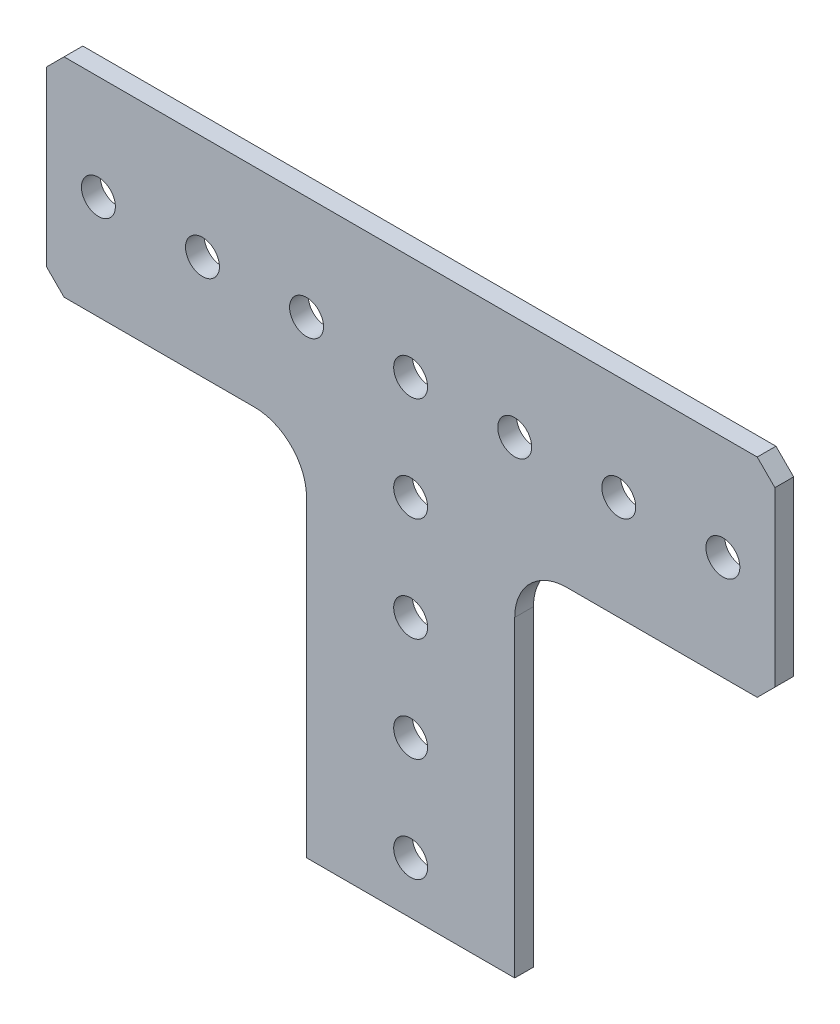
ISO-10303-21;
HEADER;
FILE_DESCRIPTION(('STEP AP214'),'2;1');
FILE_NAME('part.step','',(''),(''),'','','');
FILE_SCHEMA(('AUTOMOTIVE_DESIGN { 1 0 10303 214 1 1 1 1 }'));
ENDSEC;
DATA;
#1=APPLICATION_CONTEXT('core data for automotive mechanical design processes');
#2=APPLICATION_PROTOCOL_DEFINITION('international standard','automotive_design',2000,#1);
#3=PRODUCT_CONTEXT('',#1,'mechanical');
#4=PRODUCT('Part','Part','',(#3));
#5=PRODUCT_RELATED_PRODUCT_CATEGORY('part','',(#4));
#6=PRODUCT_DEFINITION_FORMATION('','',#4);
#7=PRODUCT_DEFINITION_CONTEXT('part definition',#1,'design');
#8=PRODUCT_DEFINITION('design','',#6,#7);
#9=PRODUCT_DEFINITION_SHAPE('','',#8);
#10=(LENGTH_UNIT() NAMED_UNIT(*) SI_UNIT(.MILLI.,.METRE.));
#11=(NAMED_UNIT(*) PLANE_ANGLE_UNIT() SI_UNIT($,.RADIAN.));
#12=(NAMED_UNIT(*) SI_UNIT($,.STERADIAN.) SOLID_ANGLE_UNIT());
#13=UNCERTAINTY_MEASURE_WITH_UNIT(LENGTH_MEASURE(1.E-05),#10,'distance_accuracy_value','');
#14=(GEOMETRIC_REPRESENTATION_CONTEXT(3) GLOBAL_UNCERTAINTY_ASSIGNED_CONTEXT((#13)) GLOBAL_UNIT_ASSIGNED_CONTEXT((#10,
#11,#12)) REPRESENTATION_CONTEXT('',''));
#15=CARTESIAN_POINT('',(0.,0.,0.));
#16=DIRECTION('',(0.,0.,1.));
#17=DIRECTION('',(1.,0.,0.));
#18=AXIS2_PLACEMENT_3D('',#15,#16,#17);
#19=CARTESIAN_POINT('',(44.45,-57.15,2.286));
#20=DIRECTION('',(0.,0.,1.));
#21=DIRECTION('',(1.,0.,0.));
#22=AXIS2_PLACEMENT_3D('',#19,#20,#21);
#23=PLANE('',#22);
#24=DIRECTION('',(-1.,0.,0.));
#25=VECTOR('',#24,1.);
#26=CARTESIAN_POINT('',(-12.7,-44.45,2.286));
#27=LINE('',#26,#25);
#28=CARTESIAN_POINT('',(12.7,-44.45,2.286));
#29=VERTEX_POINT('',#28);
#30=CARTESIAN_POINT('',(-12.7,-44.45,2.286));
#31=VERTEX_POINT('',#30);
#32=EDGE_CURVE('E344',#29,#31,#27,.T.);
#33=ORIENTED_EDGE('',*,*,#32,.F.);
#34=DIRECTION('',(0.,1.,0.));
#35=VECTOR('',#34,1.);
#36=CARTESIAN_POINT('',(12.7,0.,2.286));
#37=LINE('',#36,#35);
#38=CARTESIAN_POINT('',(12.7,-6.34999999999998,2.286));
#39=VERTEX_POINT('',#38);
#40=EDGE_CURVE('E155',#29,#39,#37,.T.);
#41=ORIENTED_EDGE('',*,*,#40,.T.);
#42=CARTESIAN_POINT('',(19.05,-6.34999999999998,2.286));
#43=DIRECTION('',(0.,0.,1.));
#44=DIRECTION('',(1.,0.,0.));
#45=AXIS2_PLACEMENT_3D('',#42,#43,#44);
#46=CIRCLE('',#45,6.35000000000001);
#47=CARTESIAN_POINT('',(19.05,0.,2.286));
#48=VERTEX_POINT('',#47);
#49=EDGE_CURVE('E272',#39,#48,#46,.F.);
#50=ORIENTED_EDGE('',*,*,#49,.T.);
#51=DIRECTION('',(-1.,0.,0.));
#52=VECTOR('',#51,1.);
#53=CARTESIAN_POINT('',(0.,0.,2.286));
#54=LINE('',#53,#52);
#55=CARTESIAN_POINT('',(42.291,0.,2.286));
#56=VERTEX_POINT('',#55);
#57=EDGE_CURVE('E237',#48,#56,#54,.F.);
#58=ORIENTED_EDGE('',*,*,#57,.T.);
#59=DIRECTION('',(-0.707106781186547,-0.707106781186548,0.));
#60=VECTOR('',#59,1.);
#61=CARTESIAN_POINT('',(44.45,2.15900000000001,2.286));
#62=LINE('',#61,#60);
#63=CARTESIAN_POINT('',(44.45,2.15900000000002,2.286));
#64=VERTEX_POINT('',#63);
#65=EDGE_CURVE('E220',#56,#64,#62,.F.);
#66=ORIENTED_EDGE('',*,*,#65,.T.);
#67=DIRECTION('',(0.,1.,0.));
#68=VECTOR('',#67,1.);
#69=CARTESIAN_POINT('',(44.45,25.4,2.286));
#70=LINE('',#69,#68);
#71=CARTESIAN_POINT('',(44.45,23.241,2.286));
#72=VERTEX_POINT('',#71);
#73=EDGE_CURVE('E231',#64,#72,#70,.T.);
#74=ORIENTED_EDGE('',*,*,#73,.T.);
#75=DIRECTION('',(0.707106781186546,-0.707106781186549,0.));
#76=VECTOR('',#75,1.);
#77=CARTESIAN_POINT('',(42.291,25.4,2.286));
#78=LINE('',#77,#76);
#79=CARTESIAN_POINT('',(42.291,25.4,2.286));
#80=VERTEX_POINT('',#79);
#81=EDGE_CURVE('E209',#72,#80,#78,.F.);
#82=ORIENTED_EDGE('',*,*,#81,.T.);
#83=DIRECTION('',(1.,0.,0.));
#84=VECTOR('',#83,1.);
#85=CARTESIAN_POINT('',(-44.45,25.4,2.286));
#86=LINE('',#85,#84);
#87=CARTESIAN_POINT('',(-42.291,25.4,2.286));
#88=VERTEX_POINT('',#87);
#89=EDGE_CURVE('E198',#80,#88,#86,.F.);
#90=ORIENTED_EDGE('',*,*,#89,.T.);
#91=DIRECTION('',(0.707106781186548,0.707106781186548,0.));
#92=VECTOR('',#91,1.);
#93=CARTESIAN_POINT('',(-44.45,23.241,2.286));
#94=LINE('',#93,#92);
#95=CARTESIAN_POINT('',(-44.45,23.241,2.286));
#96=VERTEX_POINT('',#95);
#97=EDGE_CURVE('E187',#88,#96,#94,.F.);
#98=ORIENTED_EDGE('',*,*,#97,.T.);
#99=DIRECTION('',(0.,1.,0.));
#100=VECTOR('',#99,1.);
#101=CARTESIAN_POINT('',(-44.45,25.4,2.286));
#102=LINE('',#101,#100);
#103=CARTESIAN_POINT('',(-44.45,2.15899999999999,2.286));
#104=VERTEX_POINT('',#103);
#105=EDGE_CURVE('E186',#96,#104,#102,.F.);
#106=ORIENTED_EDGE('',*,*,#105,.T.);
#107=DIRECTION('',(0.707106781186547,-0.707106781186548,0.));
#108=VECTOR('',#107,1.);
#109=CARTESIAN_POINT('',(-42.291,0.,2.286));
#110=LINE('',#109,#108);
#111=CARTESIAN_POINT('',(-42.291,0.,2.286));
#112=VERTEX_POINT('',#111);
#113=EDGE_CURVE('E175',#112,#104,#110,.F.);
#114=ORIENTED_EDGE('',*,*,#113,.F.);
#115=DIRECTION('',(1.,0.,0.));
#116=VECTOR('',#115,1.);
#117=CARTESIAN_POINT('',(0.,0.,2.286));
#118=LINE('',#117,#116);
#119=CARTESIAN_POINT('',(-19.05,0.,2.286));
#120=VERTEX_POINT('',#119);
#121=EDGE_CURVE('E146',#120,#112,#118,.F.);
#122=ORIENTED_EDGE('',*,*,#121,.F.);
#123=CARTESIAN_POINT('',(-19.05,-6.34999999999999,2.286));
#124=DIRECTION('',(0.,0.,1.));
#125=DIRECTION('',(1.,0.,0.));
#126=AXIS2_PLACEMENT_3D('',#123,#124,#125);
#127=CIRCLE('',#126,6.35000000000001);
#128=CARTESIAN_POINT('',(-12.7,-6.34999999999998,2.286));
#129=VERTEX_POINT('',#128);
#130=EDGE_CURVE('E142',#120,#129,#127,.F.);
#131=ORIENTED_EDGE('',*,*,#130,.T.);
#132=DIRECTION('',(0.,-1.,0.));
#133=VECTOR('',#132,1.);
#134=CARTESIAN_POINT('',(-12.7,0.,2.286));
#135=LINE('',#134,#133);
#136=EDGE_CURVE('E37',#31,#129,#135,.F.);
#137=ORIENTED_EDGE('',*,*,#136,.F.);
#138=EDGE_LOOP('',(#33,#41,#50,#58,#66,#74,#82,#90,#98,#106,#114,#122,#131,#137));
#139=FACE_BOUND('',#138,.T.);
#140=CARTESIAN_POINT('',(0.,-38.1,2.286));
#141=DIRECTION('',(0.,0.,-1.));
#142=DIRECTION('',(-1.,0.,0.));
#143=AXIS2_PLACEMENT_3D('',#140,#141,#142);
#144=CIRCLE('',#143,2.0701);
#145=CARTESIAN_POINT('',(-2.0701,-38.1,2.286));
#146=VERTEX_POINT('',#145);
#147=EDGE_CURVE('E228',#146,#146,#144,.T.);
#148=ORIENTED_EDGE('',*,*,#147,.T.);
#149=EDGE_LOOP('',(#148));
#150=FACE_BOUND('',#149,.T.);
#151=CARTESIAN_POINT('',(0.,-12.7,2.286));
#152=DIRECTION('',(0.,0.,-1.));
#153=DIRECTION('',(-1.,0.,0.));
#154=AXIS2_PLACEMENT_3D('',#151,#152,#153);
#155=CIRCLE('',#154,2.0701);
#156=CARTESIAN_POINT('',(-2.0701,-12.7,2.286));
#157=VERTEX_POINT('',#156);
#158=EDGE_CURVE('E311',#157,#157,#155,.T.);
#159=ORIENTED_EDGE('',*,*,#158,.T.);
#160=EDGE_LOOP('',(#159));
#161=FACE_BOUND('',#160,.T.);
#162=CARTESIAN_POINT('',(38.1,12.7,2.286));
#163=DIRECTION('',(0.,0.,-1.));
#164=DIRECTION('',(-1.,0.,0.));
#165=AXIS2_PLACEMENT_3D('',#162,#163,#164);
#166=CIRCLE('',#165,2.0701);
#167=CARTESIAN_POINT('',(36.0299,12.7,2.286));
#168=VERTEX_POINT('',#167);
#169=EDGE_CURVE('E314',#168,#168,#166,.T.);
#170=ORIENTED_EDGE('',*,*,#169,.T.);
#171=EDGE_LOOP('',(#170));
#172=FACE_BOUND('',#171,.T.);
#173=CARTESIAN_POINT('',(12.7,12.7,2.286));
#174=DIRECTION('',(0.,0.,-1.));
#175=DIRECTION('',(-1.,0.,0.));
#176=AXIS2_PLACEMENT_3D('',#173,#174,#175);
#177=CIRCLE('',#176,2.0701);
#178=CARTESIAN_POINT('',(10.6299,12.7,2.286));
#179=VERTEX_POINT('',#178);
#180=EDGE_CURVE('E317',#179,#179,#177,.T.);
#181=ORIENTED_EDGE('',*,*,#180,.T.);
#182=EDGE_LOOP('',(#181));
#183=FACE_BOUND('',#182,.T.);
#184=CARTESIAN_POINT('',(-12.7,12.7,2.286));
#185=DIRECTION('',(0.,0.,-1.));
#186=DIRECTION('',(-1.,0.,0.));
#187=AXIS2_PLACEMENT_3D('',#184,#185,#186);
#188=CIRCLE('',#187,2.0701);
#189=CARTESIAN_POINT('',(-14.7701,12.7,2.286));
#190=VERTEX_POINT('',#189);
#191=EDGE_CURVE('E320',#190,#190,#188,.T.);
#192=ORIENTED_EDGE('',*,*,#191,.T.);
#193=EDGE_LOOP('',(#192));
#194=FACE_BOUND('',#193,.T.);
#195=CARTESIAN_POINT('',(-38.1,12.7,2.286));
#196=DIRECTION('',(0.,0.,-1.));
#197=DIRECTION('',(-1.,0.,0.));
#198=AXIS2_PLACEMENT_3D('',#195,#196,#197);
#199=CIRCLE('',#198,2.0701);
#200=CARTESIAN_POINT('',(-40.1701,12.7,2.286));
#201=VERTEX_POINT('',#200);
#202=EDGE_CURVE('E323',#201,#201,#199,.T.);
#203=ORIENTED_EDGE('',*,*,#202,.T.);
#204=EDGE_LOOP('',(#203));
#205=FACE_BOUND('',#204,.T.);
#206=CARTESIAN_POINT('',(-25.4,12.7,2.286));
#207=DIRECTION('',(0.,0.,-1.));
#208=DIRECTION('',(-1.,0.,0.));
#209=AXIS2_PLACEMENT_3D('',#206,#207,#208);
#210=CIRCLE('',#209,2.0701);
#211=CARTESIAN_POINT('',(-27.4701,12.7,2.286));
#212=VERTEX_POINT('',#211);
#213=EDGE_CURVE('E326',#212,#212,#210,.T.);
#214=ORIENTED_EDGE('',*,*,#213,.T.);
#215=EDGE_LOOP('',(#214));
#216=FACE_BOUND('',#215,.T.);
#217=CARTESIAN_POINT('',(0.,12.7,2.286));
#218=DIRECTION('',(0.,0.,-1.));
#219=DIRECTION('',(-1.,0.,0.));
#220=AXIS2_PLACEMENT_3D('',#217,#218,#219);
#221=CIRCLE('',#220,2.0701);
#222=CARTESIAN_POINT('',(-2.0701,12.7,2.286));
#223=VERTEX_POINT('',#222);
#224=EDGE_CURVE('E329',#223,#223,#221,.T.);
#225=ORIENTED_EDGE('',*,*,#224,.T.);
#226=EDGE_LOOP('',(#225));
#227=FACE_BOUND('',#226,.T.);
#228=CARTESIAN_POINT('',(25.4,12.7,2.286));
#229=DIRECTION('',(0.,0.,-1.));
#230=DIRECTION('',(-1.,0.,0.));
#231=AXIS2_PLACEMENT_3D('',#228,#229,#230);
#232=CIRCLE('',#231,2.0701);
#233=CARTESIAN_POINT('',(23.3299,12.7,2.286));
#234=VERTEX_POINT('',#233);
#235=EDGE_CURVE('E332',#234,#234,#232,.T.);
#236=ORIENTED_EDGE('',*,*,#235,.T.);
#237=EDGE_LOOP('',(#236));
#238=FACE_BOUND('',#237,.T.);
#239=CARTESIAN_POINT('',(0.,0.,2.286));
#240=DIRECTION('',(0.,0.,-1.));
#241=DIRECTION('',(-1.,0.,0.));
#242=AXIS2_PLACEMENT_3D('',#239,#240,#241);
#243=CIRCLE('',#242,2.0701);
#244=CARTESIAN_POINT('',(-2.0701,0.,2.286));
#245=VERTEX_POINT('',#244);
#246=EDGE_CURVE('E334',#245,#245,#243,.T.);
#247=ORIENTED_EDGE('',*,*,#246,.T.);
#248=EDGE_LOOP('',(#247));
#249=FACE_BOUND('',#248,.T.);
#250=CARTESIAN_POINT('',(0.,-25.4,2.286));
#251=DIRECTION('',(0.,0.,-1.));
#252=DIRECTION('',(-1.,0.,0.));
#253=AXIS2_PLACEMENT_3D('',#250,#251,#252);
#254=CIRCLE('',#253,2.0701);
#255=CARTESIAN_POINT('',(-2.0701,-25.4,2.286));
#256=VERTEX_POINT('',#255);
#257=EDGE_CURVE('E255',#256,#256,#254,.T.);
#258=ORIENTED_EDGE('',*,*,#257,.T.);
#259=EDGE_LOOP('',(#258));
#260=FACE_BOUND('',#259,.T.);
#261=ADVANCED_FACE('F34',(#139,#150,#161,#172,#183,#194,#205,#216,#227,#238,#249,#260),#23,.T.);
#262=CARTESIAN_POINT('',(0.,-25.4,2.286));
#263=DIRECTION('',(0.,0.,-1.));
#264=DIRECTION('',(-1.,0.,0.));
#265=AXIS2_PLACEMENT_3D('',#262,#263,#264);
#266=CYLINDRICAL_SURFACE('',#265,2.0701);
#267=CARTESIAN_POINT('',(0.,-25.4,0.));
#268=DIRECTION('',(0.,0.,-1.));
#269=DIRECTION('',(-1.,0.,0.));
#270=AXIS2_PLACEMENT_3D('',#267,#268,#269);
#271=CIRCLE('',#270,2.0701);
#272=CARTESIAN_POINT('',(-2.0701,-25.4,0.));
#273=VERTEX_POINT('',#272);
#274=EDGE_CURVE('E234',#273,#273,#271,.T.);
#275=ORIENTED_EDGE('',*,*,#274,.T.);
#276=EDGE_LOOP('',(#275));
#277=FACE_BOUND('',#276,.T.);
#278=ORIENTED_EDGE('',*,*,#257,.F.);
#279=EDGE_LOOP('',(#278));
#280=FACE_BOUND('',#279,.T.);
#281=ADVANCED_FACE('F385',(#277,#280),#266,.F.);
#282=CARTESIAN_POINT('',(0.,0.,2.286));
#283=DIRECTION('',(0.,0.,-1.));
#284=DIRECTION('',(-1.,0.,0.));
#285=AXIS2_PLACEMENT_3D('',#282,#283,#284);
#286=CYLINDRICAL_SURFACE('',#285,2.0701);
#287=CARTESIAN_POINT('',(0.,0.,0.));
#288=DIRECTION('',(0.,0.,-1.));
#289=DIRECTION('',(-1.,0.,0.));
#290=AXIS2_PLACEMENT_3D('',#287,#288,#289);
#291=CIRCLE('',#290,2.0701);
#292=CARTESIAN_POINT('',(-2.0701,0.,0.));
#293=VERTEX_POINT('',#292);
#294=EDGE_CURVE('E378',#293,#293,#291,.T.);
#295=ORIENTED_EDGE('',*,*,#294,.T.);
#296=EDGE_LOOP('',(#295));
#297=FACE_BOUND('',#296,.T.);
#298=ORIENTED_EDGE('',*,*,#246,.F.);
#299=EDGE_LOOP('',(#298));
#300=FACE_BOUND('',#299,.T.);
#301=ADVANCED_FACE('F471',(#297,#300),#286,.F.);
#302=CARTESIAN_POINT('',(25.4,12.7,2.286));
#303=DIRECTION('',(0.,0.,-1.));
#304=DIRECTION('',(-1.,0.,0.));
#305=AXIS2_PLACEMENT_3D('',#302,#303,#304);
#306=CYLINDRICAL_SURFACE('',#305,2.0701);
#307=CARTESIAN_POINT('',(25.4,12.7,0.));
#308=DIRECTION('',(0.,0.,-1.));
#309=DIRECTION('',(-1.,0.,0.));
#310=AXIS2_PLACEMENT_3D('',#307,#308,#309);
#311=CIRCLE('',#310,2.0701);
#312=CARTESIAN_POINT('',(23.3299,12.7,0.));
#313=VERTEX_POINT('',#312);
#314=EDGE_CURVE('E376',#313,#313,#311,.T.);
#315=ORIENTED_EDGE('',*,*,#314,.T.);
#316=EDGE_LOOP('',(#315));
#317=FACE_BOUND('',#316,.T.);
#318=ORIENTED_EDGE('',*,*,#235,.F.);
#319=EDGE_LOOP('',(#318));
#320=FACE_BOUND('',#319,.T.);
#321=ADVANCED_FACE('F467',(#317,#320),#306,.F.);
#322=CARTESIAN_POINT('',(0.,12.7,2.286));
#323=DIRECTION('',(0.,0.,-1.));
#324=DIRECTION('',(-1.,0.,0.));
#325=AXIS2_PLACEMENT_3D('',#322,#323,#324);
#326=CYLINDRICAL_SURFACE('',#325,2.0701);
#327=CARTESIAN_POINT('',(0.,12.7,0.));
#328=DIRECTION('',(0.,0.,-1.));
#329=DIRECTION('',(-1.,0.,0.));
#330=AXIS2_PLACEMENT_3D('',#327,#328,#329);
#331=CIRCLE('',#330,2.0701);
#332=CARTESIAN_POINT('',(-2.0701,12.7,0.));
#333=VERTEX_POINT('',#332);
#334=EDGE_CURVE('E373',#333,#333,#331,.T.);
#335=ORIENTED_EDGE('',*,*,#334,.T.);
#336=EDGE_LOOP('',(#335));
#337=FACE_BOUND('',#336,.T.);
#338=ORIENTED_EDGE('',*,*,#224,.F.);
#339=EDGE_LOOP('',(#338));
#340=FACE_BOUND('',#339,.T.);
#341=ADVANCED_FACE('F463',(#337,#340),#326,.F.);
#342=CARTESIAN_POINT('',(-25.4,12.7,2.286));
#343=DIRECTION('',(0.,0.,-1.));
#344=DIRECTION('',(-1.,0.,0.));
#345=AXIS2_PLACEMENT_3D('',#342,#343,#344);
#346=CYLINDRICAL_SURFACE('',#345,2.0701);
#347=CARTESIAN_POINT('',(-25.4,12.7,0.));
#348=DIRECTION('',(0.,0.,-1.));
#349=DIRECTION('',(-1.,0.,0.));
#350=AXIS2_PLACEMENT_3D('',#347,#348,#349);
#351=CIRCLE('',#350,2.0701);
#352=CARTESIAN_POINT('',(-27.4701,12.7,0.));
#353=VERTEX_POINT('',#352);
#354=EDGE_CURVE('E370',#353,#353,#351,.T.);
#355=ORIENTED_EDGE('',*,*,#354,.T.);
#356=EDGE_LOOP('',(#355));
#357=FACE_BOUND('',#356,.T.);
#358=ORIENTED_EDGE('',*,*,#213,.F.);
#359=EDGE_LOOP('',(#358));
#360=FACE_BOUND('',#359,.T.);
#361=ADVANCED_FACE('F459',(#357,#360),#346,.F.);
#362=CARTESIAN_POINT('',(-38.1,12.7,2.286));
#363=DIRECTION('',(0.,0.,-1.));
#364=DIRECTION('',(-1.,0.,0.));
#365=AXIS2_PLACEMENT_3D('',#362,#363,#364);
#366=CYLINDRICAL_SURFACE('',#365,2.0701);
#367=CARTESIAN_POINT('',(-38.1,12.7,0.));
#368=DIRECTION('',(0.,0.,-1.));
#369=DIRECTION('',(-1.,0.,0.));
#370=AXIS2_PLACEMENT_3D('',#367,#368,#369);
#371=CIRCLE('',#370,2.0701);
#372=CARTESIAN_POINT('',(-40.1701,12.7,0.));
#373=VERTEX_POINT('',#372);
#374=EDGE_CURVE('E367',#373,#373,#371,.T.);
#375=ORIENTED_EDGE('',*,*,#374,.T.);
#376=EDGE_LOOP('',(#375));
#377=FACE_BOUND('',#376,.T.);
#378=ORIENTED_EDGE('',*,*,#202,.F.);
#379=EDGE_LOOP('',(#378));
#380=FACE_BOUND('',#379,.T.);
#381=ADVANCED_FACE('F455',(#377,#380),#366,.F.);
#382=CARTESIAN_POINT('',(-12.7,12.7,2.286));
#383=DIRECTION('',(0.,0.,-1.));
#384=DIRECTION('',(-1.,0.,0.));
#385=AXIS2_PLACEMENT_3D('',#382,#383,#384);
#386=CYLINDRICAL_SURFACE('',#385,2.0701);
#387=CARTESIAN_POINT('',(-12.7,12.7,0.));
#388=DIRECTION('',(0.,0.,-1.));
#389=DIRECTION('',(-1.,0.,0.));
#390=AXIS2_PLACEMENT_3D('',#387,#388,#389);
#391=CIRCLE('',#390,2.0701);
#392=CARTESIAN_POINT('',(-14.7701,12.7,0.));
#393=VERTEX_POINT('',#392);
#394=EDGE_CURVE('E364',#393,#393,#391,.T.);
#395=ORIENTED_EDGE('',*,*,#394,.T.);
#396=EDGE_LOOP('',(#395));
#397=FACE_BOUND('',#396,.T.);
#398=ORIENTED_EDGE('',*,*,#191,.F.);
#399=EDGE_LOOP('',(#398));
#400=FACE_BOUND('',#399,.T.);
#401=ADVANCED_FACE('F451',(#397,#400),#386,.F.);
#402=CARTESIAN_POINT('',(12.7,12.7,2.286));
#403=DIRECTION('',(0.,0.,-1.));
#404=DIRECTION('',(-1.,0.,0.));
#405=AXIS2_PLACEMENT_3D('',#402,#403,#404);
#406=CYLINDRICAL_SURFACE('',#405,2.0701);
#407=CARTESIAN_POINT('',(12.7,12.7,0.));
#408=DIRECTION('',(0.,0.,-1.));
#409=DIRECTION('',(-1.,0.,0.));
#410=AXIS2_PLACEMENT_3D('',#407,#408,#409);
#411=CIRCLE('',#410,2.0701);
#412=CARTESIAN_POINT('',(10.6299,12.7,0.));
#413=VERTEX_POINT('',#412);
#414=EDGE_CURVE('E361',#413,#413,#411,.T.);
#415=ORIENTED_EDGE('',*,*,#414,.T.);
#416=EDGE_LOOP('',(#415));
#417=FACE_BOUND('',#416,.T.);
#418=ORIENTED_EDGE('',*,*,#180,.F.);
#419=EDGE_LOOP('',(#418));
#420=FACE_BOUND('',#419,.T.);
#421=ADVANCED_FACE('F447',(#417,#420),#406,.F.);
#422=CARTESIAN_POINT('',(38.1,12.7,2.286));
#423=DIRECTION('',(0.,0.,-1.));
#424=DIRECTION('',(-1.,0.,0.));
#425=AXIS2_PLACEMENT_3D('',#422,#423,#424);
#426=CYLINDRICAL_SURFACE('',#425,2.0701);
#427=CARTESIAN_POINT('',(38.1,12.7,0.));
#428=DIRECTION('',(0.,0.,-1.));
#429=DIRECTION('',(-1.,0.,0.));
#430=AXIS2_PLACEMENT_3D('',#427,#428,#429);
#431=CIRCLE('',#430,2.0701);
#432=CARTESIAN_POINT('',(36.0299,12.7,0.));
#433=VERTEX_POINT('',#432);
#434=EDGE_CURVE('E358',#433,#433,#431,.T.);
#435=ORIENTED_EDGE('',*,*,#434,.T.);
#436=EDGE_LOOP('',(#435));
#437=FACE_BOUND('',#436,.T.);
#438=ORIENTED_EDGE('',*,*,#169,.F.);
#439=EDGE_LOOP('',(#438));
#440=FACE_BOUND('',#439,.T.);
#441=ADVANCED_FACE('F443',(#437,#440),#426,.F.);
#442=CARTESIAN_POINT('',(0.,-12.7,2.286));
#443=DIRECTION('',(0.,0.,-1.));
#444=DIRECTION('',(-1.,0.,0.));
#445=AXIS2_PLACEMENT_3D('',#442,#443,#444);
#446=CYLINDRICAL_SURFACE('',#445,2.0701);
#447=CARTESIAN_POINT('',(0.,-12.7,0.));
#448=DIRECTION('',(0.,0.,-1.));
#449=DIRECTION('',(-1.,0.,0.));
#450=AXIS2_PLACEMENT_3D('',#447,#448,#449);
#451=CIRCLE('',#450,2.0701);
#452=CARTESIAN_POINT('',(-2.0701,-12.7,0.));
#453=VERTEX_POINT('',#452);
#454=EDGE_CURVE('E355',#453,#453,#451,.T.);
#455=ORIENTED_EDGE('',*,*,#454,.T.);
#456=EDGE_LOOP('',(#455));
#457=FACE_BOUND('',#456,.T.);
#458=ORIENTED_EDGE('',*,*,#158,.F.);
#459=EDGE_LOOP('',(#458));
#460=FACE_BOUND('',#459,.T.);
#461=ADVANCED_FACE('F439',(#457,#460),#446,.F.);
#462=CARTESIAN_POINT('',(0.,-38.1,2.286));
#463=DIRECTION('',(0.,0.,-1.));
#464=DIRECTION('',(-1.,0.,0.));
#465=AXIS2_PLACEMENT_3D('',#462,#463,#464);
#466=CYLINDRICAL_SURFACE('',#465,2.0701);
#467=CARTESIAN_POINT('',(0.,-38.1,0.));
#468=DIRECTION('',(0.,0.,-1.));
#469=DIRECTION('',(-1.,0.,0.));
#470=AXIS2_PLACEMENT_3D('',#467,#468,#469);
#471=CIRCLE('',#470,2.0701);
#472=CARTESIAN_POINT('',(-2.0701,-38.1,0.));
#473=VERTEX_POINT('',#472);
#474=EDGE_CURVE('E214',#473,#473,#471,.T.);
#475=ORIENTED_EDGE('',*,*,#474,.T.);
#476=EDGE_LOOP('',(#475));
#477=FACE_BOUND('',#476,.T.);
#478=ORIENTED_EDGE('',*,*,#147,.F.);
#479=EDGE_LOOP('',(#478));
#480=FACE_BOUND('',#479,.T.);
#481=ADVANCED_FACE('F436',(#477,#480),#466,.F.);
#482=CARTESIAN_POINT('',(42.291,25.4,2.286));
#483=DIRECTION('',(-0.707106781186549,-0.707106781186546,0.));
#484=DIRECTION('',(0.707106781186546,-0.707106781186549,0.));
#485=AXIS2_PLACEMENT_3D('',#482,#483,#484);
#486=PLANE('',#485);
#487=DIRECTION('',(0.,0.,1.));
#488=VECTOR('',#487,1.);
#489=CARTESIAN_POINT('',(44.45,23.241,2.286));
#490=LINE('',#489,#488);
#491=CARTESIAN_POINT('',(44.45,23.241,0.));
#492=VERTEX_POINT('',#491);
#493=EDGE_CURVE('E217',#72,#492,#490,.F.);
#494=ORIENTED_EDGE('',*,*,#493,.T.);
#495=DIRECTION('',(-0.707106781186551,0.707106781186544,0.));
#496=VECTOR('',#495,1.);
#497=CARTESIAN_POINT('',(44.45,23.241,0.));
#498=LINE('',#497,#496);
#499=CARTESIAN_POINT('',(42.291,25.4,0.));
#500=VERTEX_POINT('',#499);
#501=EDGE_CURVE('E203',#492,#500,#498,.T.);
#502=ORIENTED_EDGE('',*,*,#501,.T.);
#503=DIRECTION('',(0.,0.,-1.));
#504=VECTOR('',#503,1.);
#505=CARTESIAN_POINT('',(42.291,25.4,2.286));
#506=LINE('',#505,#504);
#507=EDGE_CURVE('E206',#500,#80,#506,.F.);
#508=ORIENTED_EDGE('',*,*,#507,.T.);
#509=ORIENTED_EDGE('',*,*,#81,.F.);
#510=EDGE_LOOP('',(#494,#502,#508,#509));
#511=FACE_BOUND('',#510,.T.);
#512=ADVANCED_FACE('F432',(#511),#486,.F.);
#513=CARTESIAN_POINT('',(-44.45,25.4,2.286));
#514=DIRECTION('',(0.,-1.,0.));
#515=DIRECTION('',(0.,0.,-1.));
#516=AXIS2_PLACEMENT_3D('',#513,#514,#515);
#517=PLANE('',#516);
#518=DIRECTION('',(0.,0.,1.));
#519=VECTOR('',#518,1.);
#520=CARTESIAN_POINT('',(-42.291,25.4,2.286));
#521=LINE('',#520,#519);
#522=CARTESIAN_POINT('',(-42.291,25.4,0.));
#523=VERTEX_POINT('',#522);
#524=EDGE_CURVE('E195',#523,#88,#521,.T.);
#525=ORIENTED_EDGE('',*,*,#524,.T.);
#526=ORIENTED_EDGE('',*,*,#89,.F.);
#527=ORIENTED_EDGE('',*,*,#507,.F.);
#528=DIRECTION('',(1.,0.,0.));
#529=VECTOR('',#528,1.);
#530=CARTESIAN_POINT('',(44.45,25.4,0.));
#531=LINE('',#530,#529);
#532=EDGE_CURVE('E192',#500,#523,#531,.F.);
#533=ORIENTED_EDGE('',*,*,#532,.T.);
#534=EDGE_LOOP('',(#525,#526,#527,#533));
#535=FACE_BOUND('',#534,.T.);
#536=ADVANCED_FACE('F428',(#535),#517,.F.);
#537=CARTESIAN_POINT('',(-44.45,23.241,2.286));
#538=DIRECTION('',(0.707106781186548,-0.707106781186548,0.));
#539=DIRECTION('',(0.707106781186548,0.707106781186548,0.));
#540=AXIS2_PLACEMENT_3D('',#537,#538,#539);
#541=PLANE('',#540);
#542=ORIENTED_EDGE('',*,*,#524,.F.);
#543=DIRECTION('',(-0.707106781186548,-0.707106781186548,0.));
#544=VECTOR('',#543,1.);
#545=CARTESIAN_POINT('',(-42.291,25.4,0.));
#546=LINE('',#545,#544);
#547=CARTESIAN_POINT('',(-44.45,23.241,0.));
#548=VERTEX_POINT('',#547);
#549=EDGE_CURVE('E180',#523,#548,#546,.T.);
#550=ORIENTED_EDGE('',*,*,#549,.T.);
#551=DIRECTION('',(0.,0.,-1.));
#552=VECTOR('',#551,1.);
#553=CARTESIAN_POINT('',(-44.45,23.241,2.286));
#554=LINE('',#553,#552);
#555=EDGE_CURVE('E183',#548,#96,#554,.F.);
#556=ORIENTED_EDGE('',*,*,#555,.T.);
#557=ORIENTED_EDGE('',*,*,#97,.F.);
#558=EDGE_LOOP('',(#542,#550,#556,#557));
#559=FACE_BOUND('',#558,.T.);
#560=ADVANCED_FACE('F424',(#559),#541,.F.);
#561=CARTESIAN_POINT('',(-44.45,25.4,2.286));
#562=DIRECTION('',(1.,0.,0.));
#563=DIRECTION('',(0.,0.,-1.));
#564=AXIS2_PLACEMENT_3D('',#561,#562,#563);
#565=PLANE('',#564);
#566=DIRECTION('',(0.,0.,1.));
#567=VECTOR('',#566,1.);
#568=CARTESIAN_POINT('',(-44.45,2.15899999999999,0.));
#569=LINE('',#568,#567);
#570=CARTESIAN_POINT('',(-44.45,2.159,0.));
#571=VERTEX_POINT('',#570);
#572=EDGE_CURVE('E173',#104,#571,#569,.F.);
#573=ORIENTED_EDGE('',*,*,#572,.F.);
#574=ORIENTED_EDGE('',*,*,#105,.F.);
#575=ORIENTED_EDGE('',*,*,#555,.F.);
#576=DIRECTION('',(0.,1.,0.));
#577=VECTOR('',#576,1.);
#578=CARTESIAN_POINT('',(-44.45,-57.15,0.));
#579=LINE('',#578,#577);
#580=EDGE_CURVE('E170',#548,#571,#579,.F.);
#581=ORIENTED_EDGE('',*,*,#580,.T.);
#582=EDGE_LOOP('',(#573,#574,#575,#581));
#583=FACE_BOUND('',#582,.T.);
#584=ADVANCED_FACE('F420',(#583),#565,.F.);
#585=CARTESIAN_POINT('',(-42.291,0.,0.));
#586=DIRECTION('',(-0.707106781186548,-0.707106781186547,0.));
#587=DIRECTION('',(0.707106781186547,-0.707106781186548,0.));
#588=AXIS2_PLACEMENT_3D('',#585,#586,#587);
#589=PLANE('',#588);
#590=DIRECTION('',(0.707106781186546,-0.707106781186549,0.));
#591=VECTOR('',#590,1.);
#592=CARTESIAN_POINT('',(-44.45,2.159,0.));
#593=LINE('',#592,#591);
#594=CARTESIAN_POINT('',(-42.291,0.,0.));
#595=VERTEX_POINT('',#594);
#596=EDGE_CURVE('E166',#571,#595,#593,.T.);
#597=ORIENTED_EDGE('',*,*,#596,.T.);
#598=DIRECTION('',(0.,0.,1.));
#599=VECTOR('',#598,1.);
#600=CARTESIAN_POINT('',(-42.291,0.,0.));
#601=LINE('',#600,#599);
#602=EDGE_CURVE('E162',#112,#595,#601,.F.);
#603=ORIENTED_EDGE('',*,*,#602,.F.);
#604=ORIENTED_EDGE('',*,*,#113,.T.);
#605=ORIENTED_EDGE('',*,*,#572,.T.);
#606=EDGE_LOOP('',(#597,#603,#604,#605));
#607=FACE_BOUND('',#606,.T.);
#608=ADVANCED_FACE('F416',(#607),#589,.T.);
#609=CARTESIAN_POINT('',(0.,0.,0.));
#610=DIRECTION('',(0.,-1.,0.));
#611=DIRECTION('',(1.,0.,0.));
#612=AXIS2_PLACEMENT_3D('',#609,#610,#611);
#613=PLANE('',#612);
#614=DIRECTION('',(1.,0.,0.));
#615=VECTOR('',#614,1.);
#616=CARTESIAN_POINT('',(44.45,0.,0.));
#617=LINE('',#616,#615);
#618=CARTESIAN_POINT('',(-19.05,0.,0.));
#619=VERTEX_POINT('',#618);
#620=EDGE_CURVE('E169',#595,#619,#617,.T.);
#621=ORIENTED_EDGE('',*,*,#620,.T.);
#622=DIRECTION('',(0.,0.,1.));
#623=VECTOR('',#622,1.);
#624=CARTESIAN_POINT('',(-19.05,0.,0.));
#625=LINE('',#624,#623);
#626=EDGE_CURVE('E149',#619,#120,#625,.T.);
#627=ORIENTED_EDGE('',*,*,#626,.T.);
#628=ORIENTED_EDGE('',*,*,#121,.T.);
#629=ORIENTED_EDGE('',*,*,#602,.T.);
#630=EDGE_LOOP('',(#621,#627,#628,#629));
#631=FACE_BOUND('',#630,.T.);
#632=ADVANCED_FACE('F413',(#631),#613,.T.);
#633=CARTESIAN_POINT('',(-19.05,-6.34999999999999,0.));
#634=DIRECTION('',(0.,0.,1.));
#635=DIRECTION('',(1.,0.,0.));
#636=AXIS2_PLACEMENT_3D('',#633,#634,#635);
#637=CYLINDRICAL_SURFACE('',#636,6.35000000000001);
#638=ORIENTED_EDGE('',*,*,#626,.F.);
#639=CARTESIAN_POINT('',(-19.05,-6.34999999999999,0.));
#640=DIRECTION('',(0.,0.,1.));
#641=DIRECTION('',(1.,0.,0.));
#642=AXIS2_PLACEMENT_3D('',#639,#640,#641);
#643=CIRCLE('',#642,6.35000000000001);
#644=CARTESIAN_POINT('',(-12.7,-6.34999999999999,0.));
#645=VERTEX_POINT('',#644);
#646=EDGE_CURVE('E154',#619,#645,#643,.F.);
#647=ORIENTED_EDGE('',*,*,#646,.T.);
#648=DIRECTION('',(0.,0.,1.));
#649=VECTOR('',#648,1.);
#650=CARTESIAN_POINT('',(-12.7,-6.34999999999999,0.));
#651=LINE('',#650,#649);
#652=EDGE_CURVE('E137',#129,#645,#651,.F.);
#653=ORIENTED_EDGE('',*,*,#652,.F.);
#654=ORIENTED_EDGE('',*,*,#130,.F.);
#655=EDGE_LOOP('',(#638,#647,#653,#654));
#656=FACE_BOUND('',#655,.T.);
#657=ADVANCED_FACE('F152',(#656),#637,.F.);
#658=CARTESIAN_POINT('',(-12.7,0.,0.));
#659=DIRECTION('',(-1.,0.,0.));
#660=DIRECTION('',(0.,-1.,0.));
#661=AXIS2_PLACEMENT_3D('',#658,#659,#660);
#662=PLANE('',#661);
#663=DIRECTION('',(0.,0.,1.));
#664=VECTOR('',#663,1.);
#665=CARTESIAN_POINT('',(-12.7,-44.45,-0.000103077640753631));
#666=LINE('',#665,#664);
#667=CARTESIAN_POINT('',(-12.7,-44.45,0.));
#668=VERTEX_POINT('',#667);
#669=EDGE_CURVE('E51',#668,#31,#666,.T.);
#670=ORIENTED_EDGE('',*,*,#669,.T.);
#671=ORIENTED_EDGE('',*,*,#136,.T.);
#672=ORIENTED_EDGE('',*,*,#652,.T.);
#673=DIRECTION('',(0.,1.,0.));
#674=VECTOR('',#673,1.);
#675=CARTESIAN_POINT('',(-12.7,-57.15,0.));
#676=LINE('',#675,#674);
#677=EDGE_CURVE('E254',#645,#668,#676,.F.);
#678=ORIENTED_EDGE('',*,*,#677,.T.);
#679=EDGE_LOOP('',(#670,#671,#672,#678));
#680=FACE_BOUND('',#679,.T.);
#681=ADVANCED_FACE('F134',(#680),#662,.T.);
#682=CARTESIAN_POINT('',(12.7,0.,0.));
#683=DIRECTION('',(-1.,0.,0.));
#684=DIRECTION('',(0.,0.,1.));
#685=AXIS2_PLACEMENT_3D('',#682,#683,#684);
#686=PLANE('',#685);
#687=ORIENTED_EDGE('',*,*,#40,.F.);
#688=DIRECTION('',(0.,0.,1.));
#689=VECTOR('',#688,1.);
#690=CARTESIAN_POINT('',(12.7,-44.45,-0.000103077640753631));
#691=LINE('',#690,#689);
#692=CARTESIAN_POINT('',(12.7,-44.45,0.));
#693=VERTEX_POINT('',#692);
#694=EDGE_CURVE('E341',#693,#29,#691,.T.);
#695=ORIENTED_EDGE('',*,*,#694,.F.);
#696=DIRECTION('',(0.,1.,0.));
#697=VECTOR('',#696,1.);
#698=CARTESIAN_POINT('',(12.7,-57.15,0.));
#699=LINE('',#698,#697);
#700=CARTESIAN_POINT('',(12.7,-6.34999999999998,0.));
#701=VERTEX_POINT('',#700);
#702=EDGE_CURVE('E250',#693,#701,#699,.T.);
#703=ORIENTED_EDGE('',*,*,#702,.T.);
#704=DIRECTION('',(0.,0.,1.));
#705=VECTOR('',#704,1.);
#706=CARTESIAN_POINT('',(12.7,-6.34999999999998,0.));
#707=LINE('',#706,#705);
#708=EDGE_CURVE('E157',#701,#39,#707,.T.);
#709=ORIENTED_EDGE('',*,*,#708,.T.);
#710=EDGE_LOOP('',(#687,#695,#703,#709));
#711=FACE_BOUND('',#710,.T.);
#712=ADVANCED_FACE('F405',(#711),#686,.F.);
#713=CARTESIAN_POINT('',(19.05,-6.34999999999998,0.));
#714=DIRECTION('',(0.,0.,1.));
#715=DIRECTION('',(1.,0.,0.));
#716=AXIS2_PLACEMENT_3D('',#713,#714,#715);
#717=CYLINDRICAL_SURFACE('',#716,6.35000000000001);
#718=ORIENTED_EDGE('',*,*,#708,.F.);
#719=CARTESIAN_POINT('',(19.05,-6.34999999999998,0.));
#720=DIRECTION('',(0.,0.,1.));
#721=DIRECTION('',(1.,0.,0.));
#722=AXIS2_PLACEMENT_3D('',#719,#720,#721);
#723=CIRCLE('',#722,6.35000000000001);
#724=CARTESIAN_POINT('',(19.05,0.,0.));
#725=VERTEX_POINT('',#724);
#726=EDGE_CURVE('E253',#701,#725,#723,.F.);
#727=ORIENTED_EDGE('',*,*,#726,.T.);
#728=DIRECTION('',(0.,0.,1.));
#729=VECTOR('',#728,1.);
#730=CARTESIAN_POINT('',(19.05,0.,0.));
#731=LINE('',#730,#729);
#732=EDGE_CURVE('E240',#725,#48,#731,.T.);
#733=ORIENTED_EDGE('',*,*,#732,.T.);
#734=ORIENTED_EDGE('',*,*,#49,.F.);
#735=EDGE_LOOP('',(#718,#727,#733,#734));
#736=FACE_BOUND('',#735,.T.);
#737=ADVANCED_FACE('F402',(#736),#717,.F.);
#738=CARTESIAN_POINT('',(0.,0.,0.));
#739=DIRECTION('',(0.,1.,0.));
#740=DIRECTION('',(-1.,0.,0.));
#741=AXIS2_PLACEMENT_3D('',#738,#739,#740);
#742=PLANE('',#741);
#743=DIRECTION('',(0.,0.,1.));
#744=VECTOR('',#743,1.);
#745=CARTESIAN_POINT('',(42.291,0.,2.286));
#746=LINE('',#745,#744);
#747=CARTESIAN_POINT('',(42.291,0.,0.));
#748=VERTEX_POINT('',#747);
#749=EDGE_CURVE('E239',#748,#56,#746,.T.);
#750=ORIENTED_EDGE('',*,*,#749,.T.);
#751=ORIENTED_EDGE('',*,*,#57,.F.);
#752=ORIENTED_EDGE('',*,*,#732,.F.);
#753=DIRECTION('',(1.,0.,0.));
#754=VECTOR('',#753,1.);
#755=CARTESIAN_POINT('',(44.45,0.,0.));
#756=LINE('',#755,#754);
#757=EDGE_CURVE('E275',#725,#748,#756,.T.);
#758=ORIENTED_EDGE('',*,*,#757,.T.);
#759=EDGE_LOOP('',(#750,#751,#752,#758));
#760=FACE_BOUND('',#759,.T.);
#761=ADVANCED_FACE('F283',(#760),#742,.F.);
#762=CARTESIAN_POINT('',(44.45,2.15900000000001,2.286));
#763=DIRECTION('',(-0.707106781186548,0.707106781186547,0.));
#764=DIRECTION('',(-0.707106781186547,-0.707106781186548,0.));
#765=AXIS2_PLACEMENT_3D('',#762,#763,#764);
#766=PLANE('',#765);
#767=ORIENTED_EDGE('',*,*,#749,.F.);
#768=DIRECTION('',(0.707106781186547,0.707106781186547,0.));
#769=VECTOR('',#768,1.);
#770=CARTESIAN_POINT('',(42.291,0.,0.));
#771=LINE('',#770,#769);
#772=CARTESIAN_POINT('',(44.45,2.15900000000002,0.));
#773=VERTEX_POINT('',#772);
#774=EDGE_CURVE('E224',#748,#773,#771,.T.);
#775=ORIENTED_EDGE('',*,*,#774,.T.);
#776=DIRECTION('',(0.,0.,1.));
#777=VECTOR('',#776,1.);
#778=CARTESIAN_POINT('',(44.45,2.15900000000001,2.286));
#779=LINE('',#778,#777);
#780=EDGE_CURVE('E59',#773,#64,#779,.T.);
#781=ORIENTED_EDGE('',*,*,#780,.T.);
#782=ORIENTED_EDGE('',*,*,#65,.F.);
#783=EDGE_LOOP('',(#767,#775,#781,#782));
#784=FACE_BOUND('',#783,.T.);
#785=ADVANCED_FACE('F288',(#784),#766,.F.);
#786=CARTESIAN_POINT('',(44.45,25.4,2.286));
#787=DIRECTION('',(-1.,0.,0.));
#788=DIRECTION('',(0.,0.,1.));
#789=AXIS2_PLACEMENT_3D('',#786,#787,#788);
#790=PLANE('',#789);
#791=ORIENTED_EDGE('',*,*,#780,.F.);
#792=DIRECTION('',(0.,1.,0.));
#793=VECTOR('',#792,1.);
#794=CARTESIAN_POINT('',(44.45,-57.15,0.));
#795=LINE('',#794,#793);
#796=EDGE_CURVE('E43',#773,#492,#795,.T.);
#797=ORIENTED_EDGE('',*,*,#796,.T.);
#798=ORIENTED_EDGE('',*,*,#493,.F.);
#799=ORIENTED_EDGE('',*,*,#73,.F.);
#800=EDGE_LOOP('',(#791,#797,#798,#799));
#801=FACE_BOUND('',#800,.T.);
#802=ADVANCED_FACE('F297',(#801),#790,.F.);
#803=CARTESIAN_POINT('',(44.45,-57.15,0.));
#804=DIRECTION('',(0.,0.,1.));
#805=DIRECTION('',(1.,0.,0.));
#806=AXIS2_PLACEMENT_3D('',#803,#804,#805);
#807=PLANE('',#806);
#808=ORIENTED_EDGE('',*,*,#702,.F.);
#809=DIRECTION('',(-1.,0.,0.));
#810=VECTOR('',#809,1.);
#811=CARTESIAN_POINT('',(44.45,-44.45,0.));
#812=LINE('',#811,#810);
#813=EDGE_CURVE('E11',#693,#668,#812,.T.);
#814=ORIENTED_EDGE('',*,*,#813,.T.);
#815=ORIENTED_EDGE('',*,*,#677,.F.);
#816=ORIENTED_EDGE('',*,*,#646,.F.);
#817=ORIENTED_EDGE('',*,*,#620,.F.);
#818=ORIENTED_EDGE('',*,*,#596,.F.);
#819=ORIENTED_EDGE('',*,*,#580,.F.);
#820=ORIENTED_EDGE('',*,*,#549,.F.);
#821=ORIENTED_EDGE('',*,*,#532,.F.);
#822=ORIENTED_EDGE('',*,*,#501,.F.);
#823=ORIENTED_EDGE('',*,*,#796,.F.);
#824=ORIENTED_EDGE('',*,*,#774,.F.);
#825=ORIENTED_EDGE('',*,*,#757,.F.);
#826=ORIENTED_EDGE('',*,*,#726,.F.);
#827=EDGE_LOOP('',(#808,#814,#815,#816,#817,#818,#819,#820,#821,#822,#823,#824,#825,#826));
#828=FACE_BOUND('',#827,.T.);
#829=ORIENTED_EDGE('',*,*,#474,.F.);
#830=EDGE_LOOP('',(#829));
#831=FACE_BOUND('',#830,.T.);
#832=ORIENTED_EDGE('',*,*,#454,.F.);
#833=EDGE_LOOP('',(#832));
#834=FACE_BOUND('',#833,.T.);
#835=ORIENTED_EDGE('',*,*,#434,.F.);
#836=EDGE_LOOP('',(#835));
#837=FACE_BOUND('',#836,.T.);
#838=ORIENTED_EDGE('',*,*,#414,.F.);
#839=EDGE_LOOP('',(#838));
#840=FACE_BOUND('',#839,.T.);
#841=ORIENTED_EDGE('',*,*,#394,.F.);
#842=EDGE_LOOP('',(#841));
#843=FACE_BOUND('',#842,.T.);
#844=ORIENTED_EDGE('',*,*,#374,.F.);
#845=EDGE_LOOP('',(#844));
#846=FACE_BOUND('',#845,.T.);
#847=ORIENTED_EDGE('',*,*,#354,.F.);
#848=EDGE_LOOP('',(#847));
#849=FACE_BOUND('',#848,.T.);
#850=ORIENTED_EDGE('',*,*,#334,.F.);
#851=EDGE_LOOP('',(#850));
#852=FACE_BOUND('',#851,.T.);
#853=ORIENTED_EDGE('',*,*,#314,.F.);
#854=EDGE_LOOP('',(#853));
#855=FACE_BOUND('',#854,.T.);
#856=ORIENTED_EDGE('',*,*,#294,.F.);
#857=EDGE_LOOP('',(#856));
#858=FACE_BOUND('',#857,.T.);
#859=ORIENTED_EDGE('',*,*,#274,.F.);
#860=EDGE_LOOP('',(#859));
#861=FACE_BOUND('',#860,.T.);
#862=ADVANCED_FACE('F291',(#828,#831,#834,#837,#840,#843,#846,#849,#852,#855,#858,#861),#807,.F.);
#863=CARTESIAN_POINT('',(-12.7,-44.45,-0.000103077640753631));
#864=DIRECTION('',(0.,1.,0.));
#865=DIRECTION('',(0.,0.,1.));
#866=AXIS2_PLACEMENT_3D('',#863,#864,#865);
#867=PLANE('',#866);
#868=ORIENTED_EDGE('',*,*,#694,.T.);
#869=ORIENTED_EDGE('',*,*,#32,.T.);
#870=ORIENTED_EDGE('',*,*,#669,.F.);
#871=ORIENTED_EDGE('',*,*,#813,.F.);
#872=EDGE_LOOP('',(#868,#869,#870,#871));
#873=FACE_BOUND('',#872,.T.);
#874=ADVANCED_FACE('F389',(#873),#867,.F.);
#875=CLOSED_SHELL('',(#261,#281,#301,#321,#341,#361,#381,#401,#421,#441,#461,#481,#512,#536,
#560,#584,#608,#632,#657,#681,#712,#737,#761,#785,#802,#862,#874));
#876=MANIFOLD_SOLID_BREP('B2',#875);
#877=ADVANCED_BREP_SHAPE_REPRESENTATION('',(#18,#876),#14);
#878=SHAPE_DEFINITION_REPRESENTATION(#9,#877);
ENDSEC;
END-ISO-10303-21;
